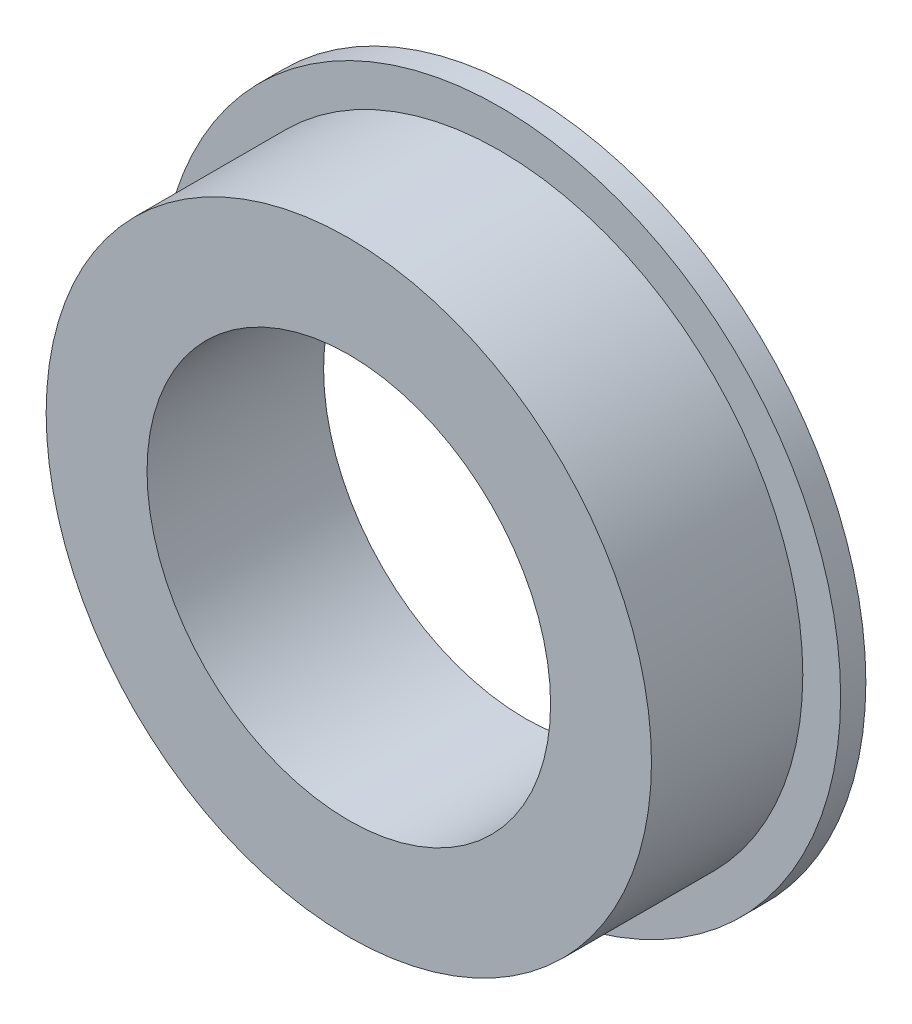
ISO-10303-21;
HEADER;
FILE_DESCRIPTION(('STEP AP214'),'2;1');
FILE_NAME('part.step','',(''),(''),'','','');
FILE_SCHEMA(('AUTOMOTIVE_DESIGN { 1 0 10303 214 1 1 1 1 }'));
ENDSEC;
DATA;
#1=APPLICATION_CONTEXT('core data for automotive mechanical design processes');
#2=APPLICATION_PROTOCOL_DEFINITION('international standard','automotive_design',2000,#1);
#3=PRODUCT_CONTEXT('',#1,'mechanical');
#4=PRODUCT('Part','Part','',(#3));
#5=PRODUCT_RELATED_PRODUCT_CATEGORY('part','',(#4));
#6=PRODUCT_DEFINITION_FORMATION('','',#4);
#7=PRODUCT_DEFINITION_CONTEXT('part definition',#1,'design');
#8=PRODUCT_DEFINITION('design','',#6,#7);
#9=PRODUCT_DEFINITION_SHAPE('','',#8);
#10=(LENGTH_UNIT() NAMED_UNIT(*) SI_UNIT(.MILLI.,.METRE.));
#11=(NAMED_UNIT(*) PLANE_ANGLE_UNIT() SI_UNIT($,.RADIAN.));
#12=(NAMED_UNIT(*) SI_UNIT($,.STERADIAN.) SOLID_ANGLE_UNIT());
#13=UNCERTAINTY_MEASURE_WITH_UNIT(LENGTH_MEASURE(1.E-05),#10,'distance_accuracy_value','');
#14=(GEOMETRIC_REPRESENTATION_CONTEXT(3) GLOBAL_UNCERTAINTY_ASSIGNED_CONTEXT((#13)) GLOBAL_UNIT_ASSIGNED_CONTEXT((#10,
#11,#12)) REPRESENTATION_CONTEXT('',''));
#15=CARTESIAN_POINT('',(0.,0.,0.));
#16=DIRECTION('',(0.,0.,1.));
#17=DIRECTION('',(1.,0.,0.));
#18=AXIS2_PLACEMENT_3D('',#15,#16,#17);
#19=CARTESIAN_POINT('',(0.,0.,0.5));
#20=DIRECTION('',(0.,0.,1.));
#21=DIRECTION('',(1.,0.,0.));
#22=AXIS2_PLACEMENT_3D('',#19,#20,#21);
#23=PLANE('',#22);
#24=CARTESIAN_POINT('',(0.,0.,0.5));
#25=DIRECTION('',(0.,0.,1.));
#26=DIRECTION('',(1.,0.,0.));
#27=AXIS2_PLACEMENT_3D('',#24,#25,#26);
#28=CIRCLE('',#27,6.);
#29=CARTESIAN_POINT('',(6.,0.,0.5));
#30=VERTEX_POINT('',#29);
#31=EDGE_CURVE('E10',#30,#30,#28,.T.);
#32=ORIENTED_EDGE('',*,*,#31,.F.);
#33=EDGE_LOOP('',(#32));
#34=FACE_BOUND('',#33,.T.);
#35=CARTESIAN_POINT('',(0.,0.,0.5));
#36=DIRECTION('',(0.,0.,1.));
#37=DIRECTION('',(1.,0.,0.));
#38=AXIS2_PLACEMENT_3D('',#35,#36,#37);
#39=CIRCLE('',#38,6.75);
#40=CARTESIAN_POINT('',(6.75,0.,0.5));
#41=VERTEX_POINT('',#40);
#42=EDGE_CURVE('E40',#41,#41,#39,.T.);
#43=ORIENTED_EDGE('',*,*,#42,.T.);
#44=EDGE_LOOP('',(#43));
#45=FACE_BOUND('',#44,.T.);
#46=ADVANCED_FACE('F32',(#34,#45),#23,.T.);
#47=CARTESIAN_POINT('',(0.,0.,0.));
#48=DIRECTION('',(0.,0.,1.));
#49=DIRECTION('',(1.,0.,0.));
#50=AXIS2_PLACEMENT_3D('',#47,#48,#49);
#51=PLANE('',#50);
#52=CARTESIAN_POINT('',(0.,0.,0.));
#53=DIRECTION('',(0.,0.,1.));
#54=DIRECTION('',(1.,0.,0.));
#55=AXIS2_PLACEMENT_3D('',#52,#53,#54);
#56=CIRCLE('',#55,6.75);
#57=CARTESIAN_POINT('',(6.75,0.,0.));
#58=VERTEX_POINT('',#57);
#59=EDGE_CURVE('E36',#58,#58,#56,.T.);
#60=ORIENTED_EDGE('',*,*,#59,.F.);
#61=EDGE_LOOP('',(#60));
#62=FACE_BOUND('',#61,.T.);
#63=CARTESIAN_POINT('',(0.,0.,0.));
#64=DIRECTION('',(0.,0.,1.));
#65=DIRECTION('',(1.,0.,0.));
#66=AXIS2_PLACEMENT_3D('',#63,#64,#65);
#67=CIRCLE('',#66,4.);
#68=CARTESIAN_POINT('',(4.,0.,0.));
#69=VERTEX_POINT('',#68);
#70=EDGE_CURVE('E49',#69,#69,#67,.T.);
#71=ORIENTED_EDGE('',*,*,#70,.T.);
#72=EDGE_LOOP('',(#71));
#73=FACE_BOUND('',#72,.T.);
#74=ADVANCED_FACE('F76',(#62,#73),#51,.F.);
#75=CARTESIAN_POINT('',(0.,0.,0.5));
#76=DIRECTION('',(0.,0.,-1.));
#77=DIRECTION('',(-1.,0.,0.));
#78=AXIS2_PLACEMENT_3D('',#75,#76,#77);
#79=CYLINDRICAL_SURFACE('',#78,6.75);
#80=ORIENTED_EDGE('',*,*,#42,.F.);
#81=EDGE_LOOP('',(#80));
#82=FACE_BOUND('',#81,.T.);
#83=ORIENTED_EDGE('',*,*,#59,.T.);
#84=EDGE_LOOP('',(#83));
#85=FACE_BOUND('',#84,.T.);
#86=ADVANCED_FACE('F34',(#82,#85),#79,.T.);
#87=CARTESIAN_POINT('',(0.,0.,0.5));
#88=DIRECTION('',(0.,0.,-1.));
#89=DIRECTION('',(-1.,0.,0.));
#90=AXIS2_PLACEMENT_3D('',#87,#88,#89);
#91=CYLINDRICAL_SURFACE('',#90,4.);
#92=ORIENTED_EDGE('',*,*,#70,.F.);
#93=EDGE_LOOP('',(#92));
#94=FACE_BOUND('',#93,.T.);
#95=CARTESIAN_POINT('',(0.,0.,3.5));
#96=DIRECTION('',(0.,0.,1.));
#97=DIRECTION('',(1.,0.,0.));
#98=AXIS2_PLACEMENT_3D('',#95,#96,#97);
#99=CIRCLE('',#98,4.);
#100=CARTESIAN_POINT('',(4.,0.,3.5));
#101=VERTEX_POINT('',#100);
#102=EDGE_CURVE('E55',#101,#101,#99,.T.);
#103=ORIENTED_EDGE('',*,*,#102,.T.);
#104=EDGE_LOOP('',(#103));
#105=FACE_BOUND('',#104,.T.);
#106=ADVANCED_FACE('F61',(#94,#105),#91,.F.);
#107=CARTESIAN_POINT('',(0.,0.,3.5));
#108=DIRECTION('',(0.,0.,1.));
#109=DIRECTION('',(1.,0.,0.));
#110=AXIS2_PLACEMENT_3D('',#107,#108,#109);
#111=PLANE('',#110);
#112=CARTESIAN_POINT('',(0.,0.,3.5));
#113=DIRECTION('',(0.,0.,1.));
#114=DIRECTION('',(1.,0.,0.));
#115=AXIS2_PLACEMENT_3D('',#112,#113,#114);
#116=CIRCLE('',#115,6.);
#117=CARTESIAN_POINT('',(6.,0.,3.5));
#118=VERTEX_POINT('',#117);
#119=EDGE_CURVE('E47',#118,#118,#116,.T.);
#120=ORIENTED_EDGE('',*,*,#119,.T.);
#121=EDGE_LOOP('',(#120));
#122=FACE_BOUND('',#121,.T.);
#123=ORIENTED_EDGE('',*,*,#102,.F.);
#124=EDGE_LOOP('',(#123));
#125=FACE_BOUND('',#124,.T.);
#126=ADVANCED_FACE('F63',(#122,#125),#111,.T.);
#127=CARTESIAN_POINT('',(0.,0.,3.5));
#128=DIRECTION('',(0.,0.,-1.));
#129=DIRECTION('',(-1.,0.,0.));
#130=AXIS2_PLACEMENT_3D('',#127,#128,#129);
#131=CYLINDRICAL_SURFACE('',#130,6.);
#132=ORIENTED_EDGE('',*,*,#119,.F.);
#133=EDGE_LOOP('',(#132));
#134=FACE_BOUND('',#133,.T.);
#135=ORIENTED_EDGE('',*,*,#31,.T.);
#136=EDGE_LOOP('',(#135));
#137=FACE_BOUND('',#136,.T.);
#138=ADVANCED_FACE('F65',(#134,#137),#131,.T.);
#139=CLOSED_SHELL('',(#46,#74,#86,#106,#126,#138));
#140=MANIFOLD_SOLID_BREP('B2',#139);
#141=ADVANCED_BREP_SHAPE_REPRESENTATION('',(#18,#140),#14);
#142=SHAPE_DEFINITION_REPRESENTATION(#9,#141);
ENDSEC;
END-ISO-10303-21;
